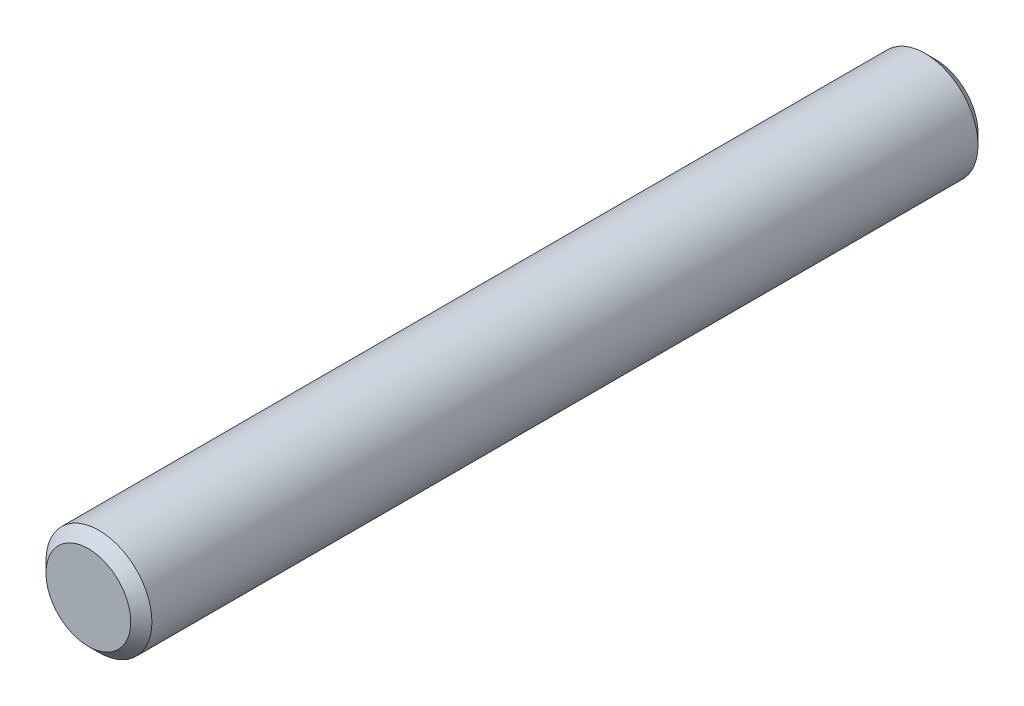
ISO-10303-21;
HEADER;
FILE_DESCRIPTION(('STEP AP214'),'2;1');
FILE_NAME('part.step','',(''),(''),'','','');
FILE_SCHEMA(('AUTOMOTIVE_DESIGN { 1 0 10303 214 1 1 1 1 }'));
ENDSEC;
DATA;
#1=APPLICATION_CONTEXT('core data for automotive mechanical design processes');
#2=APPLICATION_PROTOCOL_DEFINITION('international standard','automotive_design',2000,#1);
#3=PRODUCT_CONTEXT('',#1,'mechanical');
#4=PRODUCT('Part','Part','',(#3));
#5=PRODUCT_RELATED_PRODUCT_CATEGORY('part','',(#4));
#6=PRODUCT_DEFINITION_FORMATION('','',#4);
#7=PRODUCT_DEFINITION_CONTEXT('part definition',#1,'design');
#8=PRODUCT_DEFINITION('design','',#6,#7);
#9=PRODUCT_DEFINITION_SHAPE('','',#8);
#10=(LENGTH_UNIT() NAMED_UNIT(*) SI_UNIT(.MILLI.,.METRE.));
#11=(NAMED_UNIT(*) PLANE_ANGLE_UNIT() SI_UNIT($,.RADIAN.));
#12=(NAMED_UNIT(*) SI_UNIT($,.STERADIAN.) SOLID_ANGLE_UNIT());
#13=UNCERTAINTY_MEASURE_WITH_UNIT(LENGTH_MEASURE(1.E-05),#10,'distance_accuracy_value','');
#14=(GEOMETRIC_REPRESENTATION_CONTEXT(3) GLOBAL_UNCERTAINTY_ASSIGNED_CONTEXT((#13)) GLOBAL_UNIT_ASSIGNED_CONTEXT((#10,
#11,#12)) REPRESENTATION_CONTEXT('',''));
#15=CARTESIAN_POINT('',(0.,0.,0.));
#16=DIRECTION('',(0.,0.,1.));
#17=DIRECTION('',(1.,0.,0.));
#18=AXIS2_PLACEMENT_3D('',#15,#16,#17);
#19=CARTESIAN_POINT('',(0.,0.,-11.6999999999519));
#20=DIRECTION('',(0.,0.,1.));
#21=DIRECTION('',(1.,0.,0.));
#22=AXIS2_PLACEMENT_3D('',#19,#20,#21);
#23=CONICAL_SURFACE('',#22,1.49999999999173,0.785398163397449);
#24=CARTESIAN_POINT('',(0.,0.,-11.9999999999038));
#25=DIRECTION('',(0.,0.,1.));
#26=DIRECTION('',(1.,0.,0.));
#27=AXIS2_PLACEMENT_3D('',#24,#25,#26);
#28=CIRCLE('',#27,1.20000000003984);
#29=CARTESIAN_POINT('',(1.20000000003984,0.,-11.9999999999038));
#30=VERTEX_POINT('',#29);
#31=EDGE_CURVE('E45',#30,#30,#28,.T.);
#32=ORIENTED_EDGE('',*,*,#31,.T.);
#33=EDGE_LOOP('',(#32));
#34=FACE_BOUND('',#33,.T.);
#35=CARTESIAN_POINT('',(0.,0.,-11.6999999999519));
#36=DIRECTION('',(0.,0.,1.));
#37=DIRECTION('',(1.,0.,0.));
#38=AXIS2_PLACEMENT_3D('',#35,#36,#37);
#39=CIRCLE('',#38,1.49999999999173);
#40=CARTESIAN_POINT('',(1.49999999999172,0.,-11.6999999999519));
#41=VERTEX_POINT('',#40);
#42=EDGE_CURVE('E10',#41,#41,#39,.T.);
#43=ORIENTED_EDGE('',*,*,#42,.F.);
#44=EDGE_LOOP('',(#43));
#45=FACE_BOUND('',#44,.T.);
#46=ADVANCED_FACE('F31',(#34,#45),#23,.T.);
#47=CARTESIAN_POINT('',(0.,0.,-11.9999999999038));
#48=DIRECTION('',(0.,0.,1.));
#49=DIRECTION('',(1.,0.,0.));
#50=AXIS2_PLACEMENT_3D('',#47,#48,#49);
#51=CYLINDRICAL_SURFACE('',#50,1.49999999999173);
#52=ORIENTED_EDGE('',*,*,#42,.T.);
#53=EDGE_LOOP('',(#52));
#54=FACE_BOUND('',#53,.T.);
#55=CARTESIAN_POINT('',(0.,0.,11.7000000000481));
#56=DIRECTION('',(0.,0.,1.));
#57=DIRECTION('',(1.,0.,0.));
#58=AXIS2_PLACEMENT_3D('',#55,#56,#57);
#59=CIRCLE('',#58,1.49999999999172);
#60=CARTESIAN_POINT('',(1.49999999999172,0.,11.7000000000481));
#61=VERTEX_POINT('',#60);
#62=EDGE_CURVE('E37',#61,#61,#59,.T.);
#63=ORIENTED_EDGE('',*,*,#62,.F.);
#64=EDGE_LOOP('',(#63));
#65=FACE_BOUND('',#64,.T.);
#66=ADVANCED_FACE('F64',(#54,#65),#51,.T.);
#67=CARTESIAN_POINT('',(0.,0.,12.));
#68=DIRECTION('',(0.,0.,-1.));
#69=DIRECTION('',(-1.,0.,0.));
#70=AXIS2_PLACEMENT_3D('',#67,#68,#69);
#71=CONICAL_SURFACE('',#70,1.20000000003984,0.785398163397444);
#72=ORIENTED_EDGE('',*,*,#62,.T.);
#73=EDGE_LOOP('',(#72));
#74=FACE_BOUND('',#73,.T.);
#75=CARTESIAN_POINT('',(0.,0.,12.));
#76=DIRECTION('',(0.,0.,1.));
#77=DIRECTION('',(1.,0.,0.));
#78=AXIS2_PLACEMENT_3D('',#75,#76,#77);
#79=CIRCLE('',#78,1.20000000003984);
#80=CARTESIAN_POINT('',(1.20000000003984,0.,12.));
#81=VERTEX_POINT('',#80);
#82=EDGE_CURVE('E41',#81,#81,#79,.T.);
#83=ORIENTED_EDGE('',*,*,#82,.F.);
#84=EDGE_LOOP('',(#83));
#85=FACE_BOUND('',#84,.T.);
#86=ADVANCED_FACE('F60',(#74,#85),#71,.T.);
#87=CARTESIAN_POINT('',(0.,0.,12.));
#88=DIRECTION('',(0.,0.,1.));
#89=DIRECTION('',(1.,0.,0.));
#90=AXIS2_PLACEMENT_3D('',#87,#88,#89);
#91=PLANE('',#90);
#92=ORIENTED_EDGE('',*,*,#82,.T.);
#93=EDGE_LOOP('',(#92));
#94=FACE_BOUND('',#93,.T.);
#95=ADVANCED_FACE('F55',(#94),#91,.T.);
#96=CARTESIAN_POINT('',(1.20000000003984,0.,-11.9999999999038));
#97=DIRECTION('',(0.,0.,-1.));
#98=DIRECTION('',(-1.,0.,0.));
#99=AXIS2_PLACEMENT_3D('',#96,#97,#98);
#100=PLANE('',#99);
#101=ORIENTED_EDGE('',*,*,#31,.F.);
#102=EDGE_LOOP('',(#101));
#103=FACE_BOUND('',#102,.T.);
#104=ADVANCED_FACE('F53',(#103),#100,.T.);
#105=CLOSED_SHELL('',(#46,#66,#86,#95,#104));
#106=MANIFOLD_SOLID_BREP('B2',#105);
#107=ADVANCED_BREP_SHAPE_REPRESENTATION('',(#18,#106),#14);
#108=SHAPE_DEFINITION_REPRESENTATION(#9,#107);
ENDSEC;
END-ISO-10303-21;
